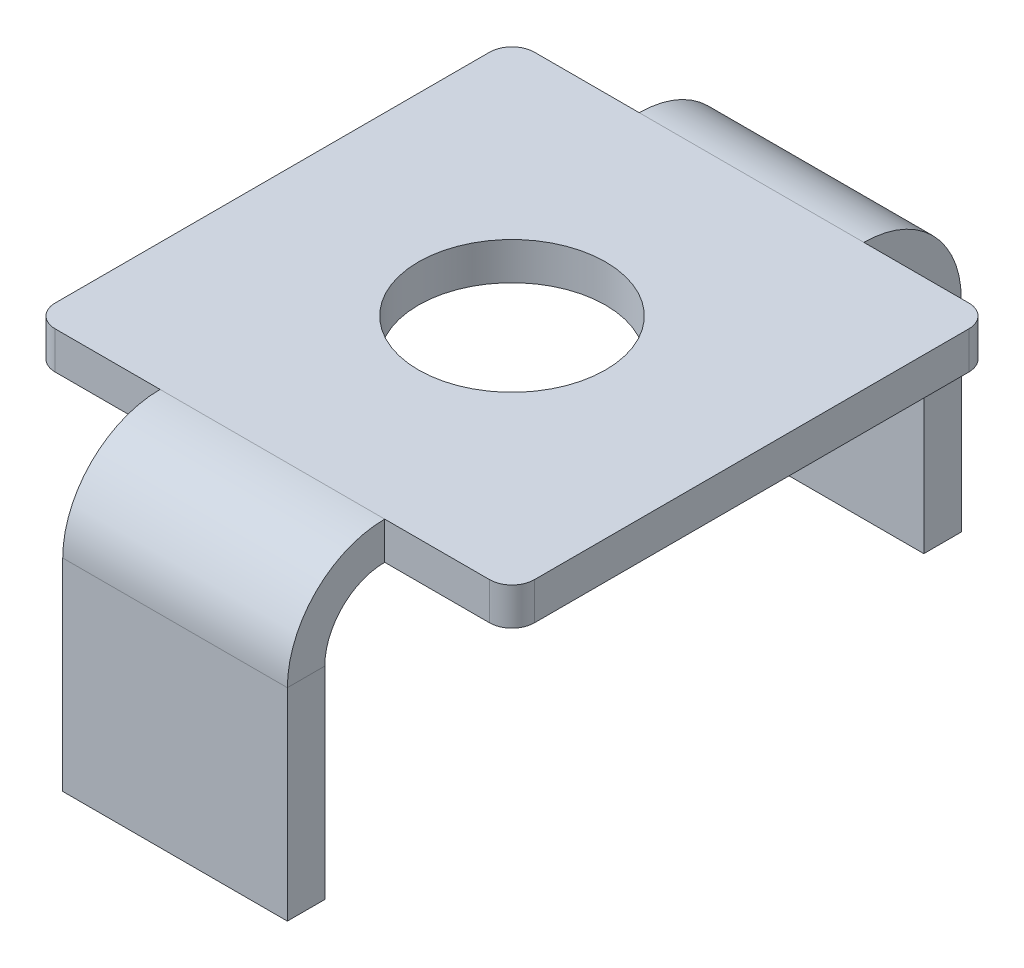
ISO-10303-21;
HEADER;
FILE_DESCRIPTION(('STEP AP214'),'2;1');
FILE_NAME('part.step','',(''),(''),'','','');
FILE_SCHEMA(('AUTOMOTIVE_DESIGN { 1 0 10303 214 1 1 1 1 }'));
ENDSEC;
DATA;
#1=APPLICATION_CONTEXT('core data for automotive mechanical design processes');
#2=APPLICATION_PROTOCOL_DEFINITION('international standard','automotive_design',2000,#1);
#3=PRODUCT_CONTEXT('',#1,'mechanical');
#4=PRODUCT('Part','Part','',(#3));
#5=PRODUCT_RELATED_PRODUCT_CATEGORY('part','',(#4));
#6=PRODUCT_DEFINITION_FORMATION('','',#4);
#7=PRODUCT_DEFINITION_CONTEXT('part definition',#1,'design');
#8=PRODUCT_DEFINITION('design','',#6,#7);
#9=PRODUCT_DEFINITION_SHAPE('','',#8);
#10=(LENGTH_UNIT() NAMED_UNIT(*) SI_UNIT(.MILLI.,.METRE.));
#11=(NAMED_UNIT(*) PLANE_ANGLE_UNIT() SI_UNIT($,.RADIAN.));
#12=(NAMED_UNIT(*) SI_UNIT($,.STERADIAN.) SOLID_ANGLE_UNIT());
#13=UNCERTAINTY_MEASURE_WITH_UNIT(LENGTH_MEASURE(1.E-05),#10,'distance_accuracy_value','');
#14=(GEOMETRIC_REPRESENTATION_CONTEXT(3) GLOBAL_UNCERTAINTY_ASSIGNED_CONTEXT((#13)) GLOBAL_UNIT_ASSIGNED_CONTEXT((#10,
#11,#12)) REPRESENTATION_CONTEXT('',''));
#15=CARTESIAN_POINT('',(0.,0.,0.));
#16=DIRECTION('',(0.,0.,1.));
#17=DIRECTION('',(1.,0.,0.));
#18=AXIS2_PLACEMENT_3D('',#15,#16,#17);
#19=CARTESIAN_POINT('',(-3.2,0.,-3.2));
#20=DIRECTION('',(0.,0.,-1.));
#21=DIRECTION('',(-1.,0.,0.));
#22=AXIS2_PLACEMENT_3D('',#19,#20,#21);
#23=PLANE('',#22);
#24=DIRECTION('',(1.,0.,0.));
#25=VECTOR('',#24,1.);
#26=CARTESIAN_POINT('',(0.,0.5,-3.2));
#27=LINE('',#26,#25);
#28=CARTESIAN_POINT('',(2.9,0.5,-3.2));
#29=VERTEX_POINT('',#28);
#30=CARTESIAN_POINT('',(1.5,0.5,-3.2));
#31=VERTEX_POINT('',#30);
#32=EDGE_CURVE('E342',#29,#31,#27,.F.);
#33=ORIENTED_EDGE('',*,*,#32,.F.);
#34=DIRECTION('',(0.,-1.,0.));
#35=VECTOR('',#34,1.);
#36=CARTESIAN_POINT('',(2.9,0.,-3.2));
#37=LINE('',#36,#35);
#38=CARTESIAN_POINT('',(2.9,0.,-3.2));
#39=VERTEX_POINT('',#38);
#40=EDGE_CURVE('E388',#29,#39,#37,.T.);
#41=ORIENTED_EDGE('',*,*,#40,.T.);
#42=DIRECTION('',(-1.,0.,0.));
#43=VECTOR('',#42,1.);
#44=CARTESIAN_POINT('',(-3.2,0.,-3.2));
#45=LINE('',#44,#43);
#46=CARTESIAN_POINT('',(1.5,0.,-3.2));
#47=VERTEX_POINT('',#46);
#48=EDGE_CURVE('E352',#39,#47,#45,.T.);
#49=ORIENTED_EDGE('',*,*,#48,.T.);
#50=DIRECTION('',(0.,1.,0.));
#51=VECTOR('',#50,1.);
#52=CARTESIAN_POINT('',(1.5,0.,-3.2));
#53=LINE('',#52,#51);
#54=EDGE_CURVE('E270',#47,#31,#53,.T.);
#55=ORIENTED_EDGE('',*,*,#54,.T.);
#56=EDGE_LOOP('',(#33,#41,#49,#55));
#57=FACE_BOUND('',#56,.T.);
#58=ADVANCED_FACE('F82',(#57),#23,.T.);
#59=CARTESIAN_POINT('',(-3.2,0.,3.2));
#60=DIRECTION('',(0.,0.,1.));
#61=DIRECTION('',(1.,0.,0.));
#62=AXIS2_PLACEMENT_3D('',#59,#60,#61);
#63=PLANE('',#62);
#64=DIRECTION('',(1.,0.,0.));
#65=VECTOR('',#64,1.);
#66=CARTESIAN_POINT('',(0.,0.5,3.2));
#67=LINE('',#66,#65);
#68=CARTESIAN_POINT('',(-2.9,0.5,3.2));
#69=VERTEX_POINT('',#68);
#70=CARTESIAN_POINT('',(-1.5,0.5,3.2));
#71=VERTEX_POINT('',#70);
#72=EDGE_CURVE('E365',#69,#71,#67,.T.);
#73=ORIENTED_EDGE('',*,*,#72,.F.);
#74=DIRECTION('',(0.,-1.,0.));
#75=VECTOR('',#74,1.);
#76=CARTESIAN_POINT('',(-2.9,0.,3.2));
#77=LINE('',#76,#75);
#78=CARTESIAN_POINT('',(-2.9,0.,3.2));
#79=VERTEX_POINT('',#78);
#80=EDGE_CURVE('E13',#69,#79,#77,.T.);
#81=ORIENTED_EDGE('',*,*,#80,.T.);
#82=DIRECTION('',(1.,0.,0.));
#83=VECTOR('',#82,1.);
#84=CARTESIAN_POINT('',(-3.2,0.,3.2));
#85=LINE('',#84,#83);
#86=CARTESIAN_POINT('',(-1.5,0.,3.2));
#87=VERTEX_POINT('',#86);
#88=EDGE_CURVE('E346',#79,#87,#85,.T.);
#89=ORIENTED_EDGE('',*,*,#88,.T.);
#90=DIRECTION('',(0.,1.,0.));
#91=VECTOR('',#90,1.);
#92=CARTESIAN_POINT('',(-1.5,0.,3.2));
#93=LINE('',#92,#91);
#94=EDGE_CURVE('E323',#87,#71,#93,.T.);
#95=ORIENTED_EDGE('',*,*,#94,.T.);
#96=EDGE_LOOP('',(#73,#81,#89,#95));
#97=FACE_BOUND('',#96,.T.);
#98=ADVANCED_FACE('F453',(#97),#63,.T.);
#99=CARTESIAN_POINT('',(-3.2,0.,-3.2));
#100=DIRECTION('',(-1.,0.,0.));
#101=DIRECTION('',(0.,0.,1.));
#102=AXIS2_PLACEMENT_3D('',#99,#100,#101);
#103=PLANE('',#102);
#104=DIRECTION('',(0.,0.,1.));
#105=VECTOR('',#104,1.);
#106=CARTESIAN_POINT('',(-3.2,0.5,0.));
#107=LINE('',#106,#105);
#108=CARTESIAN_POINT('',(-3.2,0.5,-2.9));
#109=VERTEX_POINT('',#108);
#110=CARTESIAN_POINT('',(-3.2,0.5,2.9));
#111=VERTEX_POINT('',#110);
#112=EDGE_CURVE('E363',#109,#111,#107,.T.);
#113=ORIENTED_EDGE('',*,*,#112,.F.);
#114=DIRECTION('',(0.,-1.,0.));
#115=VECTOR('',#114,1.);
#116=CARTESIAN_POINT('',(-3.2,0.,-2.9));
#117=LINE('',#116,#115);
#118=CARTESIAN_POINT('',(-3.2,0.,-2.9));
#119=VERTEX_POINT('',#118);
#120=EDGE_CURVE('E368',#109,#119,#117,.T.);
#121=ORIENTED_EDGE('',*,*,#120,.T.);
#122=DIRECTION('',(0.,0.,1.));
#123=VECTOR('',#122,1.);
#124=CARTESIAN_POINT('',(-3.2,0.,-3.2));
#125=LINE('',#124,#123);
#126=CARTESIAN_POINT('',(-3.2,0.,2.9));
#127=VERTEX_POINT('',#126);
#128=EDGE_CURVE('E348',#119,#127,#125,.T.);
#129=ORIENTED_EDGE('',*,*,#128,.T.);
#130=DIRECTION('',(0.,-1.,0.));
#131=VECTOR('',#130,1.);
#132=CARTESIAN_POINT('',(-3.2,0.,2.9));
#133=LINE('',#132,#131);
#134=EDGE_CURVE('E354',#127,#111,#133,.F.);
#135=ORIENTED_EDGE('',*,*,#134,.T.);
#136=EDGE_LOOP('',(#113,#121,#129,#135));
#137=FACE_BOUND('',#136,.T.);
#138=ADVANCED_FACE('F458',(#137),#103,.T.);
#139=CARTESIAN_POINT('',(-1.5,0.,-3.2));
#140=VERTEX_POINT('',#139);
#141=CARTESIAN_POINT('',(-2.9,0.,-3.2));
#142=VERTEX_POINT('',#141);
#143=EDGE_CURVE('E351',#140,#142,#45,.T.);
#144=ORIENTED_EDGE('',*,*,#143,.T.);
#145=DIRECTION('',(0.,-1.,0.));
#146=VECTOR('',#145,1.);
#147=CARTESIAN_POINT('',(-2.9,0.,-3.2));
#148=LINE('',#147,#146);
#149=CARTESIAN_POINT('',(-2.9,0.5,-3.2));
#150=VERTEX_POINT('',#149);
#151=EDGE_CURVE('E379',#142,#150,#148,.F.);
#152=ORIENTED_EDGE('',*,*,#151,.T.);
#153=CARTESIAN_POINT('',(-1.5,0.499999999999998,-3.2));
#154=VERTEX_POINT('',#153);
#155=EDGE_CURVE('E362',#154,#150,#27,.F.);
#156=ORIENTED_EDGE('',*,*,#155,.F.);
#157=DIRECTION('',(0.,1.,0.));
#158=VECTOR('',#157,1.);
#159=CARTESIAN_POINT('',(-1.5,0.,-3.2));
#160=LINE('',#159,#158);
#161=EDGE_CURVE('E281',#140,#154,#160,.T.);
#162=ORIENTED_EDGE('',*,*,#161,.F.);
#163=EDGE_LOOP('',(#144,#152,#156,#162));
#164=FACE_BOUND('',#163,.T.);
#165=ADVANCED_FACE('F429',(#164),#23,.T.);
#166=CARTESIAN_POINT('',(3.2,0.,-3.2));
#167=DIRECTION('',(1.,0.,0.));
#168=DIRECTION('',(0.,0.,-1.));
#169=AXIS2_PLACEMENT_3D('',#166,#167,#168);
#170=PLANE('',#169);
#171=DIRECTION('',(0.,0.,-1.));
#172=VECTOR('',#171,1.);
#173=CARTESIAN_POINT('',(3.2,0.,-3.2));
#174=LINE('',#173,#172);
#175=CARTESIAN_POINT('',(3.2,0.,2.9));
#176=VERTEX_POINT('',#175);
#177=CARTESIAN_POINT('',(3.2,0.,-2.9));
#178=VERTEX_POINT('',#177);
#179=EDGE_CURVE('E341',#176,#178,#174,.T.);
#180=ORIENTED_EDGE('',*,*,#179,.T.);
#181=DIRECTION('',(0.,-1.,0.));
#182=VECTOR('',#181,1.);
#183=CARTESIAN_POINT('',(3.2,0.,-2.9));
#184=LINE('',#183,#182);
#185=CARTESIAN_POINT('',(3.2,0.5,-2.9));
#186=VERTEX_POINT('',#185);
#187=EDGE_CURVE('E394',#178,#186,#184,.F.);
#188=ORIENTED_EDGE('',*,*,#187,.T.);
#189=DIRECTION('',(0.,0.,1.));
#190=VECTOR('',#189,1.);
#191=CARTESIAN_POINT('',(3.2,0.5,0.));
#192=LINE('',#191,#190);
#193=CARTESIAN_POINT('',(3.2,0.5,2.9));
#194=VERTEX_POINT('',#193);
#195=EDGE_CURVE('E357',#194,#186,#192,.F.);
#196=ORIENTED_EDGE('',*,*,#195,.F.);
#197=DIRECTION('',(0.,-1.,0.));
#198=VECTOR('',#197,1.);
#199=CARTESIAN_POINT('',(3.2,0.,2.9));
#200=LINE('',#199,#198);
#201=EDGE_CURVE('E391',#194,#176,#200,.T.);
#202=ORIENTED_EDGE('',*,*,#201,.T.);
#203=EDGE_LOOP('',(#180,#188,#196,#202));
#204=FACE_BOUND('',#203,.T.);
#205=ADVANCED_FACE('F398',(#204),#170,.T.);
#206=CARTESIAN_POINT('',(0.,0.,0.));
#207=DIRECTION('',(0.,1.,0.));
#208=DIRECTION('',(0.,0.,1.));
#209=AXIS2_PLACEMENT_3D('',#206,#207,#208);
#210=CYLINDRICAL_SURFACE('',#209,1.25);
#211=CARTESIAN_POINT('',(0.,0.,0.));
#212=DIRECTION('',(0.,1.,0.));
#213=DIRECTION('',(0.,0.,1.));
#214=AXIS2_PLACEMENT_3D('',#211,#212,#213);
#215=CIRCLE('',#214,1.25);
#216=CARTESIAN_POINT('',(0.,0.,1.25));
#217=VERTEX_POINT('',#216);
#218=EDGE_CURVE('E338',#217,#217,#215,.T.);
#219=ORIENTED_EDGE('',*,*,#218,.F.);
#220=EDGE_LOOP('',(#219));
#221=FACE_BOUND('',#220,.T.);
#222=CARTESIAN_POINT('',(0.,0.5,0.));
#223=DIRECTION('',(0.,1.,0.));
#224=DIRECTION('',(0.,0.,1.));
#225=AXIS2_PLACEMENT_3D('',#222,#223,#224);
#226=CIRCLE('',#225,1.25);
#227=CARTESIAN_POINT('',(0.,0.5,1.25));
#228=VERTEX_POINT('',#227);
#229=EDGE_CURVE('E335',#228,#228,#226,.T.);
#230=ORIENTED_EDGE('',*,*,#229,.T.);
#231=EDGE_LOOP('',(#230));
#232=FACE_BOUND('',#231,.T.);
#233=ADVANCED_FACE('F469',(#221,#232),#210,.F.);
#234=CARTESIAN_POINT('',(1.5,0.,3.2));
#235=VERTEX_POINT('',#234);
#236=CARTESIAN_POINT('',(2.9,0.,3.2));
#237=VERTEX_POINT('',#236);
#238=EDGE_CURVE('E345',#235,#237,#85,.T.);
#239=ORIENTED_EDGE('',*,*,#238,.T.);
#240=DIRECTION('',(0.,-1.,0.));
#241=VECTOR('',#240,1.);
#242=CARTESIAN_POINT('',(2.9,0.,3.2));
#243=LINE('',#242,#241);
#244=CARTESIAN_POINT('',(2.9,0.5,3.2));
#245=VERTEX_POINT('',#244);
#246=EDGE_CURVE('E90',#237,#245,#243,.F.);
#247=ORIENTED_EDGE('',*,*,#246,.T.);
#248=CARTESIAN_POINT('',(1.5,0.500000000000003,3.2));
#249=VERTEX_POINT('',#248);
#250=EDGE_CURVE('E360',#249,#245,#67,.T.);
#251=ORIENTED_EDGE('',*,*,#250,.F.);
#252=DIRECTION('',(0.,1.,0.));
#253=VECTOR('',#252,1.);
#254=CARTESIAN_POINT('',(1.5,0.,3.2));
#255=LINE('',#254,#253);
#256=EDGE_CURVE('E333',#235,#249,#255,.T.);
#257=ORIENTED_EDGE('',*,*,#256,.F.);
#258=EDGE_LOOP('',(#239,#247,#251,#257));
#259=FACE_BOUND('',#258,.T.);
#260=ADVANCED_FACE('F461',(#259),#63,.T.);
#261=CARTESIAN_POINT('',(0.,0.,0.));
#262=DIRECTION('',(0.,1.,0.));
#263=DIRECTION('',(0.,0.,1.));
#264=AXIS2_PLACEMENT_3D('',#261,#262,#263);
#265=PLANE('',#264);
#266=ORIENTED_EDGE('',*,*,#218,.T.);
#267=EDGE_LOOP('',(#266));
#268=FACE_BOUND('',#267,.T.);
#269=ORIENTED_EDGE('',*,*,#128,.F.);
#270=CARTESIAN_POINT('',(-2.9,0.,-2.9));
#271=DIRECTION('',(0.,1.,0.));
#272=DIRECTION('',(0.,0.,1.));
#273=AXIS2_PLACEMENT_3D('',#270,#271,#272);
#274=CIRCLE('',#273,0.3);
#275=EDGE_CURVE('E377',#119,#142,#274,.F.);
#276=ORIENTED_EDGE('',*,*,#275,.T.);
#277=ORIENTED_EDGE('',*,*,#143,.F.);
#278=DIRECTION('',(1.,0.,0.));
#279=VECTOR('',#278,1.);
#280=CARTESIAN_POINT('',(1.5,0.,-3.2));
#281=LINE('',#280,#279);
#282=EDGE_CURVE('E276',#47,#140,#281,.F.);
#283=ORIENTED_EDGE('',*,*,#282,.F.);
#284=ORIENTED_EDGE('',*,*,#48,.F.);
#285=CARTESIAN_POINT('',(2.9,0.,-2.9));
#286=DIRECTION('',(0.,1.,0.));
#287=DIRECTION('',(0.,0.,1.));
#288=AXIS2_PLACEMENT_3D('',#285,#286,#287);
#289=CIRCLE('',#288,0.3);
#290=EDGE_CURVE('E375',#39,#178,#289,.F.);
#291=ORIENTED_EDGE('',*,*,#290,.T.);
#292=ORIENTED_EDGE('',*,*,#179,.F.);
#293=CARTESIAN_POINT('',(2.9,0.,2.9));
#294=DIRECTION('',(0.,1.,0.));
#295=DIRECTION('',(0.,0.,1.));
#296=AXIS2_PLACEMENT_3D('',#293,#294,#295);
#297=CIRCLE('',#296,0.3);
#298=EDGE_CURVE('E373',#176,#237,#297,.F.);
#299=ORIENTED_EDGE('',*,*,#298,.T.);
#300=ORIENTED_EDGE('',*,*,#238,.F.);
#301=DIRECTION('',(-1.,0.,0.));
#302=VECTOR('',#301,1.);
#303=CARTESIAN_POINT('',(-1.5,0.,3.2));
#304=LINE('',#303,#302);
#305=EDGE_CURVE('E329',#87,#235,#304,.F.);
#306=ORIENTED_EDGE('',*,*,#305,.F.);
#307=ORIENTED_EDGE('',*,*,#88,.F.);
#308=CARTESIAN_POINT('',(-2.9,0.,2.9));
#309=DIRECTION('',(0.,1.,0.));
#310=DIRECTION('',(0.,0.,1.));
#311=AXIS2_PLACEMENT_3D('',#308,#309,#310);
#312=CIRCLE('',#311,0.3);
#313=EDGE_CURVE('E371',#79,#127,#312,.F.);
#314=ORIENTED_EDGE('',*,*,#313,.T.);
#315=EDGE_LOOP('',(#269,#276,#277,#283,#284,#291,#292,#299,#300,#306,#307,#314));
#316=FACE_BOUND('',#315,.T.);
#317=ADVANCED_FACE('F415',(#268,#316),#265,.F.);
#318=CARTESIAN_POINT('',(0.,0.5,0.));
#319=DIRECTION('',(0.,1.,0.));
#320=DIRECTION('',(0.,0.,1.));
#321=AXIS2_PLACEMENT_3D('',#318,#319,#320);
#322=PLANE('',#321);
#323=ORIENTED_EDGE('',*,*,#229,.F.);
#324=EDGE_LOOP('',(#323));
#325=FACE_BOUND('',#324,.T.);
#326=ORIENTED_EDGE('',*,*,#155,.T.);
#327=CARTESIAN_POINT('',(-2.9,0.5,-2.9));
#328=DIRECTION('',(0.,1.,0.));
#329=DIRECTION('',(0.,0.,1.));
#330=AXIS2_PLACEMENT_3D('',#327,#328,#329);
#331=CIRCLE('',#330,0.3);
#332=EDGE_CURVE('E386',#150,#109,#331,.T.);
#333=ORIENTED_EDGE('',*,*,#332,.T.);
#334=ORIENTED_EDGE('',*,*,#112,.T.);
#335=CARTESIAN_POINT('',(-2.9,0.5,2.9));
#336=DIRECTION('',(0.,1.,0.));
#337=DIRECTION('',(0.,0.,1.));
#338=AXIS2_PLACEMENT_3D('',#335,#336,#337);
#339=CIRCLE('',#338,0.3);
#340=EDGE_CURVE('E104',#111,#69,#339,.T.);
#341=ORIENTED_EDGE('',*,*,#340,.T.);
#342=ORIENTED_EDGE('',*,*,#72,.T.);
#343=DIRECTION('',(-1.,0.,0.));
#344=VECTOR('',#343,1.);
#345=CARTESIAN_POINT('',(-1.5,0.500000000000003,3.2));
#346=LINE('',#345,#344);
#347=EDGE_CURVE('E316',#71,#249,#346,.F.);
#348=ORIENTED_EDGE('',*,*,#347,.T.);
#349=ORIENTED_EDGE('',*,*,#250,.T.);
#350=CARTESIAN_POINT('',(2.9,0.5,2.9));
#351=DIRECTION('',(0.,1.,0.));
#352=DIRECTION('',(0.,0.,1.));
#353=AXIS2_PLACEMENT_3D('',#350,#351,#352);
#354=CIRCLE('',#353,0.3);
#355=EDGE_CURVE('E382',#245,#194,#354,.T.);
#356=ORIENTED_EDGE('',*,*,#355,.T.);
#357=ORIENTED_EDGE('',*,*,#195,.T.);
#358=CARTESIAN_POINT('',(2.9,0.5,-2.9));
#359=DIRECTION('',(0.,1.,0.));
#360=DIRECTION('',(0.,0.,1.));
#361=AXIS2_PLACEMENT_3D('',#358,#359,#360);
#362=CIRCLE('',#361,0.3);
#363=EDGE_CURVE('E384',#186,#29,#362,.T.);
#364=ORIENTED_EDGE('',*,*,#363,.T.);
#365=ORIENTED_EDGE('',*,*,#32,.T.);
#366=DIRECTION('',(1.,0.,0.));
#367=VECTOR('',#366,1.);
#368=CARTESIAN_POINT('',(1.5,0.499999999999998,-3.2));
#369=LINE('',#368,#367);
#370=EDGE_CURVE('E263',#31,#154,#369,.F.);
#371=ORIENTED_EDGE('',*,*,#370,.T.);
#372=EDGE_LOOP('',(#326,#333,#334,#341,#342,#348,#349,#356,#357,#364,#365,#371));
#373=FACE_BOUND('',#372,.T.);
#374=ADVANCED_FACE('F404',(#325,#373),#322,.T.);
#375=CARTESIAN_POINT('',(1.5,-0.799999999999996,3.2));
#376=DIRECTION('',(1.,0.,0.));
#377=DIRECTION('',(0.,0.,-1.));
#378=AXIS2_PLACEMENT_3D('',#375,#376,#377);
#379=PLANE('',#378);
#380=DIRECTION('',(0.,0.,-1.));
#381=VECTOR('',#380,1.);
#382=CARTESIAN_POINT('',(1.5,-0.799999999999996,4.5));
#383=LINE('',#382,#381);
#384=CARTESIAN_POINT('',(1.5,-0.799999999999994,4.));
#385=VERTEX_POINT('',#384);
#386=CARTESIAN_POINT('',(1.5,-0.799999999999992,4.5));
#387=VERTEX_POINT('',#386);
#388=EDGE_CURVE('E283',#385,#387,#383,.F.);
#389=ORIENTED_EDGE('',*,*,#388,.F.);
#390=CARTESIAN_POINT('',(1.5,-0.799999999999996,3.2));
#391=DIRECTION('',(-1.,0.,0.));
#392=DIRECTION('',(0.,0.,1.));
#393=AXIS2_PLACEMENT_3D('',#390,#391,#392);
#394=CIRCLE('',#393,0.8);
#395=EDGE_CURVE('E326',#235,#385,#394,.F.);
#396=ORIENTED_EDGE('',*,*,#395,.F.);
#397=ORIENTED_EDGE('',*,*,#256,.T.);
#398=CARTESIAN_POINT('',(1.5,-0.799999999999996,3.2));
#399=DIRECTION('',(-1.,0.,0.));
#400=DIRECTION('',(0.,0.,1.));
#401=AXIS2_PLACEMENT_3D('',#398,#399,#400);
#402=CIRCLE('',#401,1.3);
#403=EDGE_CURVE('E319',#249,#387,#402,.F.);
#404=ORIENTED_EDGE('',*,*,#403,.T.);
#405=EDGE_LOOP('',(#389,#396,#397,#404));
#406=FACE_BOUND('',#405,.T.);
#407=ADVANCED_FACE('F493',(#406),#379,.T.);
#408=CARTESIAN_POINT('',(-1.5,-0.799999999999996,3.2));
#409=DIRECTION('',(1.,0.,0.));
#410=DIRECTION('',(0.,0.,-1.));
#411=AXIS2_PLACEMENT_3D('',#408,#409,#410);
#412=PLANE('',#411);
#413=CARTESIAN_POINT('',(-1.5,-0.799999999999996,3.2));
#414=DIRECTION('',(-1.,0.,0.));
#415=DIRECTION('',(0.,0.,1.));
#416=AXIS2_PLACEMENT_3D('',#413,#414,#415);
#417=CIRCLE('',#416,0.8);
#418=CARTESIAN_POINT('',(-1.5,-0.799999999999994,4.));
#419=VERTEX_POINT('',#418);
#420=EDGE_CURVE('E289',#419,#87,#417,.T.);
#421=ORIENTED_EDGE('',*,*,#420,.F.);
#422=DIRECTION('',(0.,0.,-1.));
#423=VECTOR('',#422,1.);
#424=CARTESIAN_POINT('',(-1.5,-0.799999999999996,4.));
#425=LINE('',#424,#423);
#426=CARTESIAN_POINT('',(-1.5,-0.799999999999996,4.5));
#427=VERTEX_POINT('',#426);
#428=EDGE_CURVE('E309',#419,#427,#425,.F.);
#429=ORIENTED_EDGE('',*,*,#428,.T.);
#430=CARTESIAN_POINT('',(-1.5,-0.799999999999996,3.2));
#431=DIRECTION('',(-1.,0.,0.));
#432=DIRECTION('',(0.,0.,1.));
#433=AXIS2_PLACEMENT_3D('',#430,#431,#432);
#434=CIRCLE('',#433,1.3);
#435=EDGE_CURVE('E320',#427,#71,#434,.T.);
#436=ORIENTED_EDGE('',*,*,#435,.T.);
#437=ORIENTED_EDGE('',*,*,#94,.F.);
#438=EDGE_LOOP('',(#421,#429,#436,#437));
#439=FACE_BOUND('',#438,.T.);
#440=ADVANCED_FACE('F537',(#439),#412,.F.);
#441=CARTESIAN_POINT('',(-1.5,-0.799999999999996,3.2));
#442=DIRECTION('',(-1.,0.,0.));
#443=DIRECTION('',(0.,0.,1.));
#444=AXIS2_PLACEMENT_3D('',#441,#442,#443);
#445=CYLINDRICAL_SURFACE('',#444,1.3);
#446=ORIENTED_EDGE('',*,*,#347,.F.);
#447=ORIENTED_EDGE('',*,*,#435,.F.);
#448=DIRECTION('',(-1.,0.,0.));
#449=VECTOR('',#448,1.);
#450=CARTESIAN_POINT('',(1.5,-0.799999999999996,4.5));
#451=LINE('',#450,#449);
#452=EDGE_CURVE('E307',#427,#387,#451,.F.);
#453=ORIENTED_EDGE('',*,*,#452,.T.);
#454=ORIENTED_EDGE('',*,*,#403,.F.);
#455=EDGE_LOOP('',(#446,#447,#453,#454));
#456=FACE_BOUND('',#455,.T.);
#457=ADVANCED_FACE('F496',(#456),#445,.T.);
#458=CARTESIAN_POINT('',(-1.5,-0.799999999999996,3.2));
#459=DIRECTION('',(-1.,0.,0.));
#460=DIRECTION('',(0.,0.,1.));
#461=AXIS2_PLACEMENT_3D('',#458,#459,#460);
#462=CYLINDRICAL_SURFACE('',#461,0.8);
#463=ORIENTED_EDGE('',*,*,#305,.T.);
#464=ORIENTED_EDGE('',*,*,#395,.T.);
#465=DIRECTION('',(-1.,0.,0.));
#466=VECTOR('',#465,1.);
#467=CARTESIAN_POINT('',(1.5,-0.799999999999996,4.));
#468=LINE('',#467,#466);
#469=EDGE_CURVE('E312',#385,#419,#468,.T.);
#470=ORIENTED_EDGE('',*,*,#469,.T.);
#471=ORIENTED_EDGE('',*,*,#420,.T.);
#472=EDGE_LOOP('',(#463,#464,#470,#471));
#473=FACE_BOUND('',#472,.T.);
#474=ADVANCED_FACE('F517',(#473),#462,.F.);
#475=CARTESIAN_POINT('',(-1.5,-3.5,4.50000000000001));
#476=DIRECTION('',(1.,0.,0.));
#477=DIRECTION('',(0.,0.,-1.));
#478=AXIS2_PLACEMENT_3D('',#475,#476,#477);
#479=PLANE('',#478);
#480=ORIENTED_EDGE('',*,*,#428,.F.);
#481=DIRECTION('',(0.,1.,0.));
#482=VECTOR('',#481,1.);
#483=CARTESIAN_POINT('',(-1.5,-3.5,4.00000000000001));
#484=LINE('',#483,#482);
#485=CARTESIAN_POINT('',(-1.5,-3.5,4.00000000000001));
#486=VERTEX_POINT('',#485);
#487=EDGE_CURVE('E305',#419,#486,#484,.F.);
#488=ORIENTED_EDGE('',*,*,#487,.T.);
#489=DIRECTION('',(0.,0.,-1.));
#490=VECTOR('',#489,1.);
#491=CARTESIAN_POINT('',(-1.5,-3.5,4.50000000000001));
#492=LINE('',#491,#490);
#493=CARTESIAN_POINT('',(-1.5,-3.5,4.50000000000001));
#494=VERTEX_POINT('',#493);
#495=EDGE_CURVE('E286',#494,#486,#492,.T.);
#496=ORIENTED_EDGE('',*,*,#495,.F.);
#497=DIRECTION('',(0.,-1.,0.));
#498=VECTOR('',#497,1.);
#499=CARTESIAN_POINT('',(-1.5,0.,4.5));
#500=LINE('',#499,#498);
#501=EDGE_CURVE('E298',#427,#494,#500,.T.);
#502=ORIENTED_EDGE('',*,*,#501,.F.);
#503=EDGE_LOOP('',(#480,#488,#496,#502));
#504=FACE_BOUND('',#503,.T.);
#505=ADVANCED_FACE('F506',(#504),#479,.F.);
#506=CARTESIAN_POINT('',(1.5,0.,4.5));
#507=DIRECTION('',(-1.,0.,0.));
#508=DIRECTION('',(0.,0.,1.));
#509=AXIS2_PLACEMENT_3D('',#506,#507,#508);
#510=PLANE('',#509);
#511=ORIENTED_EDGE('',*,*,#388,.T.);
#512=DIRECTION('',(0.,1.,0.));
#513=VECTOR('',#512,1.);
#514=CARTESIAN_POINT('',(1.5,0.,4.5));
#515=LINE('',#514,#513);
#516=CARTESIAN_POINT('',(1.5,-3.5,4.50000000000001));
#517=VERTEX_POINT('',#516);
#518=EDGE_CURVE('E293',#517,#387,#515,.T.);
#519=ORIENTED_EDGE('',*,*,#518,.F.);
#520=DIRECTION('',(0.,0.,-1.));
#521=VECTOR('',#520,1.);
#522=CARTESIAN_POINT('',(1.5,-3.5,4.50000000000001));
#523=LINE('',#522,#521);
#524=CARTESIAN_POINT('',(1.5,-3.5,4.00000000000001));
#525=VERTEX_POINT('',#524);
#526=EDGE_CURVE('E290',#517,#525,#523,.T.);
#527=ORIENTED_EDGE('',*,*,#526,.T.);
#528=DIRECTION('',(0.,-1.,0.));
#529=VECTOR('',#528,1.);
#530=CARTESIAN_POINT('',(1.5,0.,4.));
#531=LINE('',#530,#529);
#532=EDGE_CURVE('E300',#525,#385,#531,.F.);
#533=ORIENTED_EDGE('',*,*,#532,.T.);
#534=EDGE_LOOP('',(#511,#519,#527,#533));
#535=FACE_BOUND('',#534,.T.);
#536=ADVANCED_FACE('F514',(#535),#510,.F.);
#537=CARTESIAN_POINT('',(0.,0.,4.5));
#538=DIRECTION('',(0.,0.,-1.));
#539=DIRECTION('',(0.,1.,0.));
#540=AXIS2_PLACEMENT_3D('',#537,#538,#539);
#541=PLANE('',#540);
#542=ORIENTED_EDGE('',*,*,#452,.F.);
#543=ORIENTED_EDGE('',*,*,#501,.T.);
#544=DIRECTION('',(1.,0.,0.));
#545=VECTOR('',#544,1.);
#546=CARTESIAN_POINT('',(0.,-3.5,4.50000000000001));
#547=LINE('',#546,#545);
#548=EDGE_CURVE('E296',#494,#517,#547,.T.);
#549=ORIENTED_EDGE('',*,*,#548,.T.);
#550=ORIENTED_EDGE('',*,*,#518,.T.);
#551=EDGE_LOOP('',(#542,#543,#549,#550));
#552=FACE_BOUND('',#551,.T.);
#553=ADVANCED_FACE('F500',(#552),#541,.F.);
#554=CARTESIAN_POINT('',(0.,0.,4.));
#555=DIRECTION('',(0.,0.,-1.));
#556=DIRECTION('',(0.,1.,0.));
#557=AXIS2_PLACEMENT_3D('',#554,#555,#556);
#558=PLANE('',#557);
#559=ORIENTED_EDGE('',*,*,#487,.F.);
#560=ORIENTED_EDGE('',*,*,#469,.F.);
#561=ORIENTED_EDGE('',*,*,#532,.F.);
#562=DIRECTION('',(-1.,0.,0.));
#563=VECTOR('',#562,1.);
#564=CARTESIAN_POINT('',(1.5,-3.5,4.00000000000001));
#565=LINE('',#564,#563);
#566=EDGE_CURVE('E303',#486,#525,#565,.F.);
#567=ORIENTED_EDGE('',*,*,#566,.F.);
#568=EDGE_LOOP('',(#559,#560,#561,#567));
#569=FACE_BOUND('',#568,.T.);
#570=ADVANCED_FACE('F520',(#569),#558,.T.);
#571=CARTESIAN_POINT('',(1.5,-3.5,4.50000000000001));
#572=DIRECTION('',(0.,1.,0.));
#573=DIRECTION('',(0.,0.,1.));
#574=AXIS2_PLACEMENT_3D('',#571,#572,#573);
#575=PLANE('',#574);
#576=ORIENTED_EDGE('',*,*,#566,.T.);
#577=ORIENTED_EDGE('',*,*,#526,.F.);
#578=ORIENTED_EDGE('',*,*,#548,.F.);
#579=ORIENTED_EDGE('',*,*,#495,.T.);
#580=EDGE_LOOP('',(#576,#577,#578,#579));
#581=FACE_BOUND('',#580,.T.);
#582=ADVANCED_FACE('F510',(#581),#575,.F.);
#583=CARTESIAN_POINT('',(-1.5,-0.800000000000002,-3.2));
#584=DIRECTION('',(-1.,0.,0.));
#585=DIRECTION('',(0.,0.,1.));
#586=AXIS2_PLACEMENT_3D('',#583,#584,#585);
#587=PLANE('',#586);
#588=DIRECTION('',(0.,0.,-1.));
#589=VECTOR('',#588,1.);
#590=CARTESIAN_POINT('',(-1.5,-0.799999999999993,-4.49999999999999));
#591=LINE('',#590,#589);
#592=CARTESIAN_POINT('',(-1.5,-0.799999999999999,-4.));
#593=VERTEX_POINT('',#592);
#594=CARTESIAN_POINT('',(-1.5,-0.799999999999997,-4.5));
#595=VERTEX_POINT('',#594);
#596=EDGE_CURVE('E228',#593,#595,#591,.T.);
#597=ORIENTED_EDGE('',*,*,#596,.F.);
#598=CARTESIAN_POINT('',(-1.5,-0.800000000000002,-3.2));
#599=DIRECTION('',(1.,0.,0.));
#600=DIRECTION('',(0.,0.,-1.));
#601=AXIS2_PLACEMENT_3D('',#598,#599,#600);
#602=CIRCLE('',#601,0.8);
#603=EDGE_CURVE('E273',#140,#593,#602,.F.);
#604=ORIENTED_EDGE('',*,*,#603,.F.);
#605=ORIENTED_EDGE('',*,*,#161,.T.);
#606=CARTESIAN_POINT('',(-1.5,-0.800000000000002,-3.2));
#607=DIRECTION('',(1.,0.,0.));
#608=DIRECTION('',(0.,0.,-1.));
#609=AXIS2_PLACEMENT_3D('',#606,#607,#608);
#610=CIRCLE('',#609,1.3);
#611=EDGE_CURVE('E266',#154,#595,#610,.F.);
#612=ORIENTED_EDGE('',*,*,#611,.T.);
#613=EDGE_LOOP('',(#597,#604,#605,#612));
#614=FACE_BOUND('',#613,.T.);
#615=ADVANCED_FACE('F425',(#614),#587,.T.);
#616=CARTESIAN_POINT('',(1.5,-0.800000000000002,-3.2));
#617=DIRECTION('',(-1.,0.,0.));
#618=DIRECTION('',(0.,0.,1.));
#619=AXIS2_PLACEMENT_3D('',#616,#617,#618);
#620=PLANE('',#619);
#621=CARTESIAN_POINT('',(1.5,-0.800000000000002,-3.2));
#622=DIRECTION('',(1.,0.,0.));
#623=DIRECTION('',(0.,0.,-1.));
#624=AXIS2_PLACEMENT_3D('',#621,#622,#623);
#625=CIRCLE('',#624,0.8);
#626=CARTESIAN_POINT('',(1.5,-0.799999999999999,-4.));
#627=VERTEX_POINT('',#626);
#628=EDGE_CURVE('E278',#627,#47,#625,.T.);
#629=ORIENTED_EDGE('',*,*,#628,.F.);
#630=DIRECTION('',(0.,0.,-1.));
#631=VECTOR('',#630,1.);
#632=CARTESIAN_POINT('',(1.5,-0.799999999999996,-4.));
#633=LINE('',#632,#631);
#634=CARTESIAN_POINT('',(1.5,-0.799999999999993,-4.5));
#635=VERTEX_POINT('',#634);
#636=EDGE_CURVE('E257',#627,#635,#633,.T.);
#637=ORIENTED_EDGE('',*,*,#636,.T.);
#638=CARTESIAN_POINT('',(1.5,-0.800000000000002,-3.2));
#639=DIRECTION('',(1.,0.,0.));
#640=DIRECTION('',(0.,0.,-1.));
#641=AXIS2_PLACEMENT_3D('',#638,#639,#640);
#642=CIRCLE('',#641,1.3);
#643=EDGE_CURVE('E267',#635,#31,#642,.T.);
#644=ORIENTED_EDGE('',*,*,#643,.T.);
#645=ORIENTED_EDGE('',*,*,#54,.F.);
#646=EDGE_LOOP('',(#629,#637,#644,#645));
#647=FACE_BOUND('',#646,.T.);
#648=ADVANCED_FACE('F436',(#647),#620,.F.);
#649=CARTESIAN_POINT('',(1.5,-0.800000000000002,-3.2));
#650=DIRECTION('',(1.,0.,0.));
#651=DIRECTION('',(0.,0.,-1.));
#652=AXIS2_PLACEMENT_3D('',#649,#650,#651);
#653=CYLINDRICAL_SURFACE('',#652,1.3);
#654=ORIENTED_EDGE('',*,*,#370,.F.);
#655=ORIENTED_EDGE('',*,*,#643,.F.);
#656=DIRECTION('',(1.,0.,0.));
#657=VECTOR('',#656,1.);
#658=CARTESIAN_POINT('',(-1.5,-0.799999999999993,-4.5));
#659=LINE('',#658,#657);
#660=EDGE_CURVE('E255',#635,#595,#659,.F.);
#661=ORIENTED_EDGE('',*,*,#660,.T.);
#662=ORIENTED_EDGE('',*,*,#611,.F.);
#663=EDGE_LOOP('',(#654,#655,#661,#662));
#664=FACE_BOUND('',#663,.T.);
#665=ADVANCED_FACE('F434',(#664),#653,.T.);
#666=CARTESIAN_POINT('',(1.5,-0.800000000000002,-3.2));
#667=DIRECTION('',(1.,0.,0.));
#668=DIRECTION('',(0.,0.,-1.));
#669=AXIS2_PLACEMENT_3D('',#666,#667,#668);
#670=CYLINDRICAL_SURFACE('',#669,0.8);
#671=ORIENTED_EDGE('',*,*,#282,.T.);
#672=ORIENTED_EDGE('',*,*,#603,.T.);
#673=DIRECTION('',(1.,0.,0.));
#674=VECTOR('',#673,1.);
#675=CARTESIAN_POINT('',(-1.5,-0.799999999999996,-4.));
#676=LINE('',#675,#674);
#677=EDGE_CURVE('E260',#593,#627,#676,.T.);
#678=ORIENTED_EDGE('',*,*,#677,.T.);
#679=ORIENTED_EDGE('',*,*,#628,.T.);
#680=EDGE_LOOP('',(#671,#672,#678,#679));
#681=FACE_BOUND('',#680,.T.);
#682=ADVANCED_FACE('F420',(#681),#670,.F.);
#683=CARTESIAN_POINT('',(-1.5,-3.5,-4.50000000000001));
#684=DIRECTION('',(-1.,0.,0.));
#685=DIRECTION('',(0.,0.,1.));
#686=AXIS2_PLACEMENT_3D('',#683,#684,#685);
#687=PLANE('',#686);
#688=DIRECTION('',(0.,-1.,0.));
#689=VECTOR('',#688,1.);
#690=CARTESIAN_POINT('',(-1.5,0.,-4.));
#691=LINE('',#690,#689);
#692=CARTESIAN_POINT('',(-1.5,-3.5,-4.00000000000001));
#693=VERTEX_POINT('',#692);
#694=EDGE_CURVE('E253',#593,#693,#691,.T.);
#695=ORIENTED_EDGE('',*,*,#694,.F.);
#696=ORIENTED_EDGE('',*,*,#596,.T.);
#697=DIRECTION('',(0.,1.,0.));
#698=VECTOR('',#697,1.);
#699=CARTESIAN_POINT('',(-1.5,-3.5,-4.50000000000001));
#700=LINE('',#699,#698);
#701=CARTESIAN_POINT('',(-1.5,-3.5,-4.50000000000001));
#702=VERTEX_POINT('',#701);
#703=EDGE_CURVE('E222',#595,#702,#700,.F.);
#704=ORIENTED_EDGE('',*,*,#703,.T.);
#705=DIRECTION('',(0.,0.,1.));
#706=VECTOR('',#705,1.);
#707=CARTESIAN_POINT('',(-1.5,-3.5,-4.50000000000001));
#708=LINE('',#707,#706);
#709=EDGE_CURVE('E226',#702,#693,#708,.T.);
#710=ORIENTED_EDGE('',*,*,#709,.T.);
#711=EDGE_LOOP('',(#695,#696,#704,#710));
#712=FACE_BOUND('',#711,.T.);
#713=ADVANCED_FACE('F225',(#712),#687,.T.);
#714=CARTESIAN_POINT('',(1.5,0.,-4.5));
#715=DIRECTION('',(1.,0.,0.));
#716=DIRECTION('',(0.,0.,-1.));
#717=AXIS2_PLACEMENT_3D('',#714,#715,#716);
#718=PLANE('',#717);
#719=DIRECTION('',(0.,-1.,0.));
#720=VECTOR('',#719,1.);
#721=CARTESIAN_POINT('',(1.5,0.,-4.5));
#722=LINE('',#721,#720);
#723=CARTESIAN_POINT('',(1.5,-3.5,-4.50000000000001));
#724=VERTEX_POINT('',#723);
#725=EDGE_CURVE('E232',#724,#635,#722,.F.);
#726=ORIENTED_EDGE('',*,*,#725,.T.);
#727=ORIENTED_EDGE('',*,*,#636,.F.);
#728=DIRECTION('',(0.,1.,0.));
#729=VECTOR('',#728,1.);
#730=CARTESIAN_POINT('',(1.5,0.,-4.));
#731=LINE('',#730,#729);
#732=CARTESIAN_POINT('',(1.5,-3.5,-4.00000000000001));
#733=VERTEX_POINT('',#732);
#734=EDGE_CURVE('E250',#733,#627,#731,.T.);
#735=ORIENTED_EDGE('',*,*,#734,.F.);
#736=DIRECTION('',(0.,0.,1.));
#737=VECTOR('',#736,1.);
#738=CARTESIAN_POINT('',(1.5,-3.5,-4.50000000000001));
#739=LINE('',#738,#737);
#740=EDGE_CURVE('E240',#724,#733,#739,.T.);
#741=ORIENTED_EDGE('',*,*,#740,.F.);
#742=EDGE_LOOP('',(#726,#727,#735,#741));
#743=FACE_BOUND('',#742,.T.);
#744=ADVANCED_FACE('F440',(#743),#718,.T.);
#745=CARTESIAN_POINT('',(0.,0.,-4.5));
#746=DIRECTION('',(0.,0.,1.));
#747=DIRECTION('',(0.,1.,0.));
#748=AXIS2_PLACEMENT_3D('',#745,#746,#747);
#749=PLANE('',#748);
#750=ORIENTED_EDGE('',*,*,#660,.F.);
#751=ORIENTED_EDGE('',*,*,#725,.F.);
#752=DIRECTION('',(-1.,0.,0.));
#753=VECTOR('',#752,1.);
#754=CARTESIAN_POINT('',(1.5,-3.5,-4.50000000000001));
#755=LINE('',#754,#753);
#756=EDGE_CURVE('E238',#702,#724,#755,.F.);
#757=ORIENTED_EDGE('',*,*,#756,.F.);
#758=ORIENTED_EDGE('',*,*,#703,.F.);
#759=EDGE_LOOP('',(#750,#751,#757,#758));
#760=FACE_BOUND('',#759,.T.);
#761=ADVANCED_FACE('F243',(#760),#749,.F.);
#762=CARTESIAN_POINT('',(0.,0.,-4.));
#763=DIRECTION('',(0.,0.,1.));
#764=DIRECTION('',(0.,1.,0.));
#765=AXIS2_PLACEMENT_3D('',#762,#763,#764);
#766=PLANE('',#765);
#767=ORIENTED_EDGE('',*,*,#734,.T.);
#768=ORIENTED_EDGE('',*,*,#677,.F.);
#769=ORIENTED_EDGE('',*,*,#694,.T.);
#770=DIRECTION('',(1.,0.,0.));
#771=VECTOR('',#770,1.);
#772=CARTESIAN_POINT('',(0.,-3.5,-4.00000000000001));
#773=LINE('',#772,#771);
#774=EDGE_CURVE('E233',#693,#733,#773,.T.);
#775=ORIENTED_EDGE('',*,*,#774,.T.);
#776=EDGE_LOOP('',(#767,#768,#769,#775));
#777=FACE_BOUND('',#776,.T.);
#778=ADVANCED_FACE('F442',(#777),#766,.T.);
#779=CARTESIAN_POINT('',(1.5,-3.5,-4.50000000000001));
#780=DIRECTION('',(0.,-1.,0.));
#781=DIRECTION('',(0.,0.,-1.));
#782=AXIS2_PLACEMENT_3D('',#779,#780,#781);
#783=PLANE('',#782);
#784=ORIENTED_EDGE('',*,*,#774,.F.);
#785=ORIENTED_EDGE('',*,*,#709,.F.);
#786=ORIENTED_EDGE('',*,*,#756,.T.);
#787=ORIENTED_EDGE('',*,*,#740,.T.);
#788=EDGE_LOOP('',(#784,#785,#786,#787));
#789=FACE_BOUND('',#788,.T.);
#790=ADVANCED_FACE('F237',(#789),#783,.T.);
#791=CARTESIAN_POINT('',(-2.9,0.,-2.9));
#792=DIRECTION('',(0.,-1.,0.));
#793=DIRECTION('',(0.,0.,-1.));
#794=AXIS2_PLACEMENT_3D('',#791,#792,#793);
#795=CYLINDRICAL_SURFACE('',#794,0.3);
#796=ORIENTED_EDGE('',*,*,#332,.F.);
#797=ORIENTED_EDGE('',*,*,#151,.F.);
#798=ORIENTED_EDGE('',*,*,#275,.F.);
#799=ORIENTED_EDGE('',*,*,#120,.F.);
#800=EDGE_LOOP('',(#796,#797,#798,#799));
#801=FACE_BOUND('',#800,.T.);
#802=ADVANCED_FACE('F449',(#801),#795,.T.);
#803=CARTESIAN_POINT('',(2.9,0.,-2.9));
#804=DIRECTION('',(0.,-1.,0.));
#805=DIRECTION('',(0.,0.,-1.));
#806=AXIS2_PLACEMENT_3D('',#803,#804,#805);
#807=CYLINDRICAL_SURFACE('',#806,0.3);
#808=ORIENTED_EDGE('',*,*,#363,.F.);
#809=ORIENTED_EDGE('',*,*,#187,.F.);
#810=ORIENTED_EDGE('',*,*,#290,.F.);
#811=ORIENTED_EDGE('',*,*,#40,.F.);
#812=EDGE_LOOP('',(#808,#809,#810,#811));
#813=FACE_BOUND('',#812,.T.);
#814=ADVANCED_FACE('F408',(#813),#807,.T.);
#815=CARTESIAN_POINT('',(2.9,0.,2.9));
#816=DIRECTION('',(0.,-1.,0.));
#817=DIRECTION('',(0.,0.,-1.));
#818=AXIS2_PLACEMENT_3D('',#815,#816,#817);
#819=CYLINDRICAL_SURFACE('',#818,0.3);
#820=ORIENTED_EDGE('',*,*,#355,.F.);
#821=ORIENTED_EDGE('',*,*,#246,.F.);
#822=ORIENTED_EDGE('',*,*,#298,.F.);
#823=ORIENTED_EDGE('',*,*,#201,.F.);
#824=EDGE_LOOP('',(#820,#821,#822,#823));
#825=FACE_BOUND('',#824,.T.);
#826=ADVANCED_FACE('F480',(#825),#819,.T.);
#827=CARTESIAN_POINT('',(-2.9,0.,2.9));
#828=DIRECTION('',(0.,-1.,0.));
#829=DIRECTION('',(0.,0.,-1.));
#830=AXIS2_PLACEMENT_3D('',#827,#828,#829);
#831=CYLINDRICAL_SURFACE('',#830,0.3);
#832=ORIENTED_EDGE('',*,*,#340,.F.);
#833=ORIENTED_EDGE('',*,*,#134,.F.);
#834=ORIENTED_EDGE('',*,*,#313,.F.);
#835=ORIENTED_EDGE('',*,*,#80,.F.);
#836=EDGE_LOOP('',(#832,#833,#834,#835));
#837=FACE_BOUND('',#836,.T.);
#838=ADVANCED_FACE('F84',(#837),#831,.T.);
#839=CLOSED_SHELL('',(#58,#98,#138,#165,#205,#233,#260,#317,#374,#407,#440,#457,#474,#505,#536,
#553,#570,#582,#615,#648,#665,#682,#713,#744,#761,#778,#790,#802,#814,#826,#838));
#840=MANIFOLD_SOLID_BREP('B2',#839);
#841=ADVANCED_BREP_SHAPE_REPRESENTATION('',(#18,#840),#14);
#842=SHAPE_DEFINITION_REPRESENTATION(#9,#841);
ENDSEC;
END-ISO-10303-21;
